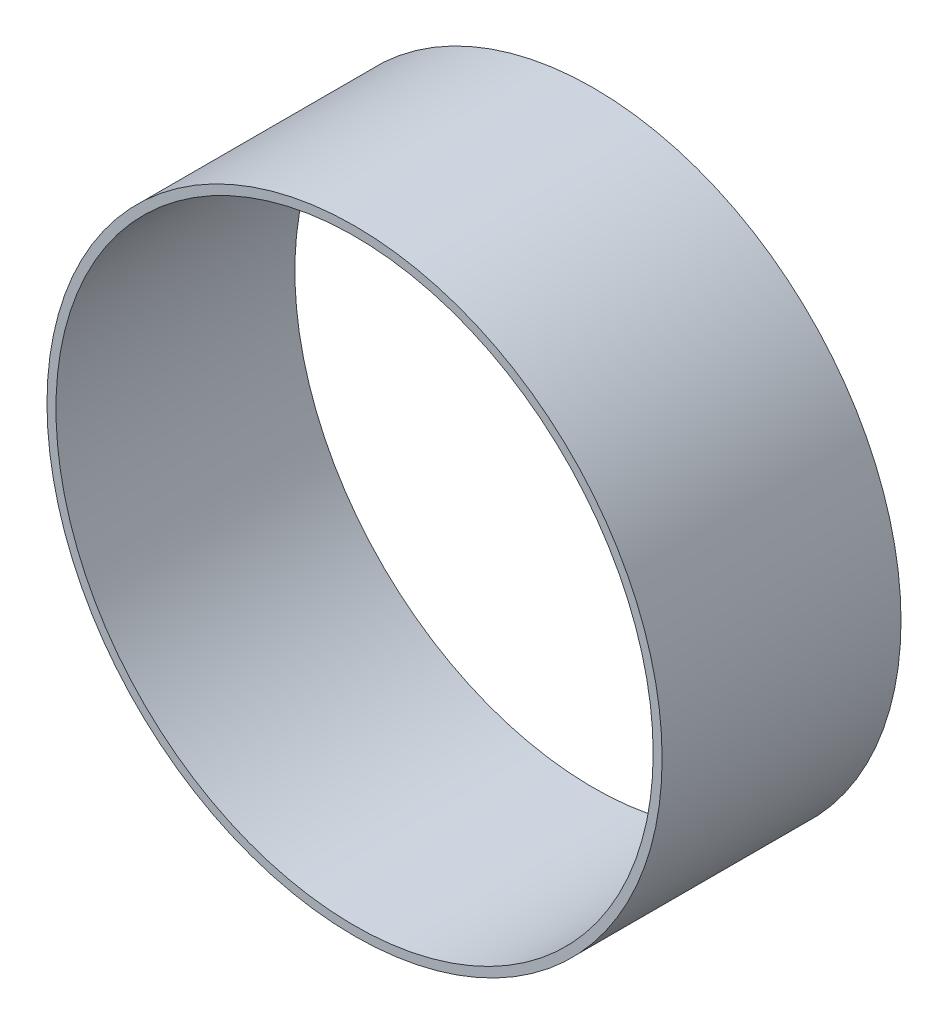
ISO-10303-21;
HEADER;
FILE_DESCRIPTION(('STEP AP214'),'2;1');
FILE_NAME('part.step','',(''),(''),'','','');
FILE_SCHEMA(('AUTOMOTIVE_DESIGN { 1 0 10303 214 1 1 1 1 }'));
ENDSEC;
DATA;
#1=APPLICATION_CONTEXT('core data for automotive mechanical design processes');
#2=APPLICATION_PROTOCOL_DEFINITION('international standard','automotive_design',2000,#1);
#3=PRODUCT_CONTEXT('',#1,'mechanical');
#4=PRODUCT('Part','Part','',(#3));
#5=PRODUCT_RELATED_PRODUCT_CATEGORY('part','',(#4));
#6=PRODUCT_DEFINITION_FORMATION('','',#4);
#7=PRODUCT_DEFINITION_CONTEXT('part definition',#1,'design');
#8=PRODUCT_DEFINITION('design','',#6,#7);
#9=PRODUCT_DEFINITION_SHAPE('','',#8);
#10=(LENGTH_UNIT() NAMED_UNIT(*) SI_UNIT(.MILLI.,.METRE.));
#11=(NAMED_UNIT(*) PLANE_ANGLE_UNIT() SI_UNIT($,.RADIAN.));
#12=(NAMED_UNIT(*) SI_UNIT($,.STERADIAN.) SOLID_ANGLE_UNIT());
#13=UNCERTAINTY_MEASURE_WITH_UNIT(LENGTH_MEASURE(1.E-05),#10,'distance_accuracy_value','');
#14=(GEOMETRIC_REPRESENTATION_CONTEXT(3) GLOBAL_UNCERTAINTY_ASSIGNED_CONTEXT((#13)) GLOBAL_UNIT_ASSIGNED_CONTEXT((#10,
#11,#12)) REPRESENTATION_CONTEXT('',''));
#15=CARTESIAN_POINT('',(0.,0.,0.));
#16=DIRECTION('',(0.,0.,1.));
#17=DIRECTION('',(1.,0.,0.));
#18=AXIS2_PLACEMENT_3D('',#15,#16,#17);
#19=CARTESIAN_POINT('',(0.,0.,25.4));
#20=DIRECTION('',(0.,0.,1.));
#21=DIRECTION('',(1.,0.,0.));
#22=AXIS2_PLACEMENT_3D('',#19,#20,#21);
#23=PLANE('',#22);
#24=CARTESIAN_POINT('',(0.,0.,25.4));
#25=DIRECTION('',(0.,0.,1.));
#26=DIRECTION('',(1.,0.,0.));
#27=AXIS2_PLACEMENT_3D('',#24,#25,#26);
#28=CIRCLE('',#27,65.405);
#29=CARTESIAN_POINT('',(65.405,0.,25.4));
#30=VERTEX_POINT('',#29);
#31=EDGE_CURVE('E10',#30,#30,#28,.T.);
#32=ORIENTED_EDGE('',*,*,#31,.T.);
#33=EDGE_LOOP('',(#32));
#34=FACE_BOUND('',#33,.T.);
#35=CARTESIAN_POINT('',(0.,0.,25.4));
#36=DIRECTION('',(0.,0.,1.));
#37=DIRECTION('',(1.,0.,0.));
#38=AXIS2_PLACEMENT_3D('',#35,#36,#37);
#39=CIRCLE('',#38,63.5);
#40=CARTESIAN_POINT('',(63.5,0.,25.4));
#41=VERTEX_POINT('',#40);
#42=EDGE_CURVE('E59',#41,#41,#39,.T.);
#43=ORIENTED_EDGE('',*,*,#42,.F.);
#44=EDGE_LOOP('',(#43));
#45=FACE_BOUND('',#44,.T.);
#46=ADVANCED_FACE('F45',(#34,#45),#23,.T.);
#47=CARTESIAN_POINT('',(0.,0.,-25.4));
#48=DIRECTION('',(0.,0.,1.));
#49=DIRECTION('',(1.,0.,0.));
#50=AXIS2_PLACEMENT_3D('',#47,#48,#49);
#51=PLANE('',#50);
#52=CARTESIAN_POINT('',(0.,0.,-25.4));
#53=DIRECTION('',(0.,0.,1.));
#54=DIRECTION('',(1.,0.,0.));
#55=AXIS2_PLACEMENT_3D('',#52,#53,#54);
#56=CIRCLE('',#55,65.405);
#57=CARTESIAN_POINT('',(65.405,0.,-25.4));
#58=VERTEX_POINT('',#57);
#59=EDGE_CURVE('E49',#58,#58,#56,.T.);
#60=ORIENTED_EDGE('',*,*,#59,.F.);
#61=EDGE_LOOP('',(#60));
#62=FACE_BOUND('',#61,.T.);
#63=CARTESIAN_POINT('',(0.,0.,-25.4));
#64=DIRECTION('',(0.,0.,1.));
#65=DIRECTION('',(1.,0.,0.));
#66=AXIS2_PLACEMENT_3D('',#63,#64,#65);
#67=CIRCLE('',#66,63.5);
#68=CARTESIAN_POINT('',(63.5,0.,-25.4));
#69=VERTEX_POINT('',#68);
#70=EDGE_CURVE('E61',#69,#69,#67,.T.);
#71=ORIENTED_EDGE('',*,*,#70,.T.);
#72=EDGE_LOOP('',(#71));
#73=FACE_BOUND('',#72,.T.);
#74=ADVANCED_FACE('F74',(#62,#73),#51,.F.);
#75=CARTESIAN_POINT('',(0.,0.,25.4));
#76=DIRECTION('',(0.,0.,-1.));
#77=DIRECTION('',(-1.,0.,0.));
#78=AXIS2_PLACEMENT_3D('',#75,#76,#77);
#79=CYLINDRICAL_SURFACE('',#78,65.405);
#80=ORIENTED_EDGE('',*,*,#31,.F.);
#81=EDGE_LOOP('',(#80));
#82=FACE_BOUND('',#81,.T.);
#83=ORIENTED_EDGE('',*,*,#59,.T.);
#84=EDGE_LOOP('',(#83));
#85=FACE_BOUND('',#84,.T.);
#86=ADVANCED_FACE('F47',(#82,#85),#79,.T.);
#87=CARTESIAN_POINT('',(0.,0.,25.4));
#88=DIRECTION('',(0.,0.,-1.));
#89=DIRECTION('',(-1.,0.,0.));
#90=AXIS2_PLACEMENT_3D('',#87,#88,#89);
#91=CYLINDRICAL_SURFACE('',#90,63.5);
#92=ORIENTED_EDGE('',*,*,#42,.T.);
#93=EDGE_LOOP('',(#92));
#94=FACE_BOUND('',#93,.T.);
#95=ORIENTED_EDGE('',*,*,#70,.F.);
#96=EDGE_LOOP('',(#95));
#97=FACE_BOUND('',#96,.T.);
#98=ADVANCED_FACE('F70',(#94,#97),#91,.F.);
#99=CLOSED_SHELL('',(#46,#74,#86,#98));
#100=MANIFOLD_SOLID_BREP('B2',#99);
#101=ADVANCED_BREP_SHAPE_REPRESENTATION('',(#18,#100),#14);
#102=SHAPE_DEFINITION_REPRESENTATION(#9,#101);
ENDSEC;
END-ISO-10303-21;
